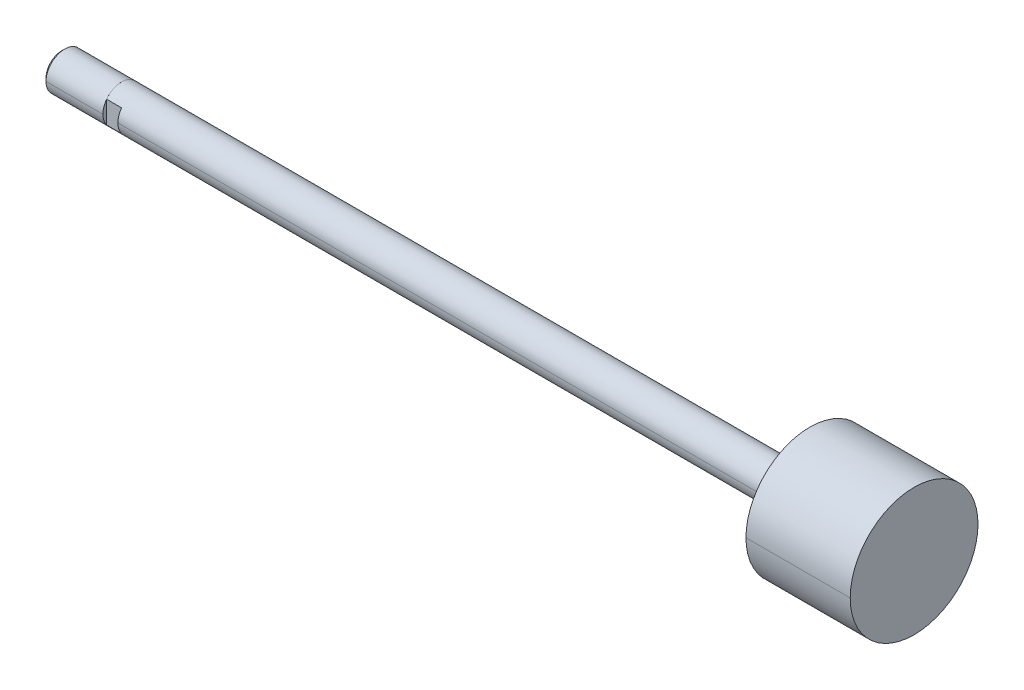
ISO-10303-21;
HEADER;
FILE_DESCRIPTION(('STEP AP214'),'2;1');
FILE_NAME('part.step','',(''),(''),'','','');
FILE_SCHEMA(('AUTOMOTIVE_DESIGN { 1 0 10303 214 1 1 1 1 }'));
ENDSEC;
DATA;
#1=APPLICATION_CONTEXT('core data for automotive mechanical design processes');
#2=APPLICATION_PROTOCOL_DEFINITION('international standard','automotive_design',2000,#1);
#3=PRODUCT_CONTEXT('',#1,'mechanical');
#4=PRODUCT('Part','Part','',(#3));
#5=PRODUCT_RELATED_PRODUCT_CATEGORY('part','',(#4));
#6=PRODUCT_DEFINITION_FORMATION('','',#4);
#7=PRODUCT_DEFINITION_CONTEXT('part definition',#1,'design');
#8=PRODUCT_DEFINITION('design','',#6,#7);
#9=PRODUCT_DEFINITION_SHAPE('','',#8);
#10=(LENGTH_UNIT() NAMED_UNIT(*) SI_UNIT(.MILLI.,.METRE.));
#11=(NAMED_UNIT(*) PLANE_ANGLE_UNIT() SI_UNIT($,.RADIAN.));
#12=(NAMED_UNIT(*) SI_UNIT($,.STERADIAN.) SOLID_ANGLE_UNIT());
#13=UNCERTAINTY_MEASURE_WITH_UNIT(LENGTH_MEASURE(1.E-05),#10,'distance_accuracy_value','');
#14=(GEOMETRIC_REPRESENTATION_CONTEXT(3) GLOBAL_UNCERTAINTY_ASSIGNED_CONTEXT((#13)) GLOBAL_UNIT_ASSIGNED_CONTEXT((#10,
#11,#12)) REPRESENTATION_CONTEXT('',''));
#15=CARTESIAN_POINT('',(0.,0.,0.));
#16=DIRECTION('',(0.,0.,1.));
#17=DIRECTION('',(1.,0.,0.));
#18=AXIS2_PLACEMENT_3D('',#15,#16,#17);
#19=CARTESIAN_POINT('',(164.9984,0.,0.));
#20=DIRECTION('',(-1.,0.,0.));
#21=DIRECTION('',(0.,-1.,0.));
#22=AXIS2_PLACEMENT_3D('',#19,#20,#21);
#23=CYLINDRICAL_SURFACE('',#22,3.9624);
#24=CARTESIAN_POINT('',(142.875,0.,0.));
#25=DIRECTION('',(1.,0.,0.));
#26=DIRECTION('',(0.,0.,-1.));
#27=AXIS2_PLACEMENT_3D('',#24,#25,#26);
#28=CIRCLE('',#27,3.9624);
#29=CARTESIAN_POINT('',(142.875,0.,-3.9624));
#30=VERTEX_POINT('',#29);
#31=CARTESIAN_POINT('',(142.875,0.,3.9624));
#32=VERTEX_POINT('',#31);
#33=EDGE_CURVE('E10',#30,#32,#28,.T.);
#34=ORIENTED_EDGE('',*,*,#33,.F.);
#35=DIRECTION('',(-1.,0.,0.));
#36=VECTOR('',#35,1.);
#37=CARTESIAN_POINT('',(142.875,0.,-3.9624));
#38=LINE('',#37,#36);
#39=CARTESIAN_POINT('',(0.,0.,-3.9624));
#40=VERTEX_POINT('',#39);
#41=EDGE_CURVE('E24',#30,#40,#38,.T.);
#42=ORIENTED_EDGE('',*,*,#41,.T.);
#43=CARTESIAN_POINT('',(0.,0.,0.));
#44=DIRECTION('',(1.,0.,0.));
#45=DIRECTION('',(0.,0.,-1.));
#46=AXIS2_PLACEMENT_3D('',#43,#44,#45);
#47=CIRCLE('',#46,3.9624);
#48=CARTESIAN_POINT('',(0.,2.37065154757084,-3.175));
#49=VERTEX_POINT('',#48);
#50=EDGE_CURVE('E244',#40,#49,#47,.T.);
#51=ORIENTED_EDGE('',*,*,#50,.T.);
#52=DIRECTION('',(1.,0.,0.));
#53=VECTOR('',#52,1.);
#54=CARTESIAN_POINT('',(164.9984,2.37065154757084,-3.175));
#55=LINE('',#54,#53);
#56=CARTESIAN_POINT('',(-3.175,2.37065154757084,-3.175));
#57=VERTEX_POINT('',#56);
#58=EDGE_CURVE('E239',#57,#49,#55,.T.);
#59=ORIENTED_EDGE('',*,*,#58,.F.);
#60=CARTESIAN_POINT('',(-3.175,0.,0.));
#61=DIRECTION('',(1.,0.,0.));
#62=DIRECTION('',(0.,0.,-1.));
#63=AXIS2_PLACEMENT_3D('',#60,#61,#62);
#64=CIRCLE('',#63,3.9624);
#65=CARTESIAN_POINT('',(-3.175,2.37065154757084,3.175));
#66=VERTEX_POINT('',#65);
#67=EDGE_CURVE('E235',#57,#66,#64,.T.);
#68=ORIENTED_EDGE('',*,*,#67,.T.);
#69=DIRECTION('',(1.,0.,0.));
#70=VECTOR('',#69,1.);
#71=CARTESIAN_POINT('',(164.9984,2.37065154757084,3.175));
#72=LINE('',#71,#70);
#73=CARTESIAN_POINT('',(0.,2.37065154757084,3.175));
#74=VERTEX_POINT('',#73);
#75=EDGE_CURVE('E231',#66,#74,#72,.T.);
#76=ORIENTED_EDGE('',*,*,#75,.T.);
#77=CARTESIAN_POINT('',(0.,0.,0.));
#78=DIRECTION('',(1.,0.,0.));
#79=DIRECTION('',(0.,0.,-1.));
#80=AXIS2_PLACEMENT_3D('',#77,#78,#79);
#81=CIRCLE('',#80,3.9624);
#82=CARTESIAN_POINT('',(0.,0.,3.9624));
#83=VERTEX_POINT('',#82);
#84=EDGE_CURVE('E227',#74,#83,#81,.T.);
#85=ORIENTED_EDGE('',*,*,#84,.T.);
#86=DIRECTION('',(-1.,0.,0.));
#87=VECTOR('',#86,1.);
#88=CARTESIAN_POINT('',(142.875,0.,3.9624));
#89=LINE('',#88,#87);
#90=EDGE_CURVE('E222',#32,#83,#89,.T.);
#91=ORIENTED_EDGE('',*,*,#90,.F.);
#92=EDGE_LOOP('',(#34,#42,#51,#59,#68,#76,#85,#91));
#93=FACE_BOUND('',#92,.T.);
#94=ADVANCED_FACE('F16',(#93),#23,.T.);
#95=CARTESIAN_POINT('',(164.9984,0.,0.));
#96=DIRECTION('',(-1.,0.,0.));
#97=DIRECTION('',(0.,1.,0.));
#98=AXIS2_PLACEMENT_3D('',#95,#96,#97);
#99=CYLINDRICAL_SURFACE('',#98,3.9624);
#100=CARTESIAN_POINT('',(0.,0.,0.));
#101=DIRECTION('',(1.,0.,0.));
#102=DIRECTION('',(0.,0.,-1.));
#103=AXIS2_PLACEMENT_3D('',#100,#101,#102);
#104=CIRCLE('',#103,3.9624);
#105=CARTESIAN_POINT('',(0.,-2.37065154757084,3.175));
#106=VERTEX_POINT('',#105);
#107=EDGE_CURVE('E218',#83,#106,#104,.T.);
#108=ORIENTED_EDGE('',*,*,#107,.T.);
#109=DIRECTION('',(1.,0.,0.));
#110=VECTOR('',#109,1.);
#111=CARTESIAN_POINT('',(164.9984,-2.37065154757084,3.175));
#112=LINE('',#111,#110);
#113=CARTESIAN_POINT('',(-3.175,-2.37065154757084,3.175));
#114=VERTEX_POINT('',#113);
#115=EDGE_CURVE('E213',#114,#106,#112,.T.);
#116=ORIENTED_EDGE('',*,*,#115,.F.);
#117=CARTESIAN_POINT('',(-3.175,0.,0.));
#118=DIRECTION('',(1.,0.,0.));
#119=DIRECTION('',(0.,0.,-1.));
#120=AXIS2_PLACEMENT_3D('',#117,#118,#119);
#121=CIRCLE('',#120,3.9624);
#122=CARTESIAN_POINT('',(-3.175,-2.37065154757084,-3.175));
#123=VERTEX_POINT('',#122);
#124=EDGE_CURVE('E209',#114,#123,#121,.T.);
#125=ORIENTED_EDGE('',*,*,#124,.T.);
#126=DIRECTION('',(1.,0.,0.));
#127=VECTOR('',#126,1.);
#128=CARTESIAN_POINT('',(164.9984,-2.37065154757084,-3.175));
#129=LINE('',#128,#127);
#130=CARTESIAN_POINT('',(0.,-2.37065154757084,-3.175));
#131=VERTEX_POINT('',#130);
#132=EDGE_CURVE('E205',#123,#131,#129,.T.);
#133=ORIENTED_EDGE('',*,*,#132,.T.);
#134=CARTESIAN_POINT('',(0.,0.,0.));
#135=DIRECTION('',(1.,0.,0.));
#136=DIRECTION('',(0.,0.,-1.));
#137=AXIS2_PLACEMENT_3D('',#134,#135,#136);
#138=CIRCLE('',#137,3.9624);
#139=EDGE_CURVE('E201',#131,#40,#138,.T.);
#140=ORIENTED_EDGE('',*,*,#139,.T.);
#141=ORIENTED_EDGE('',*,*,#41,.F.);
#142=CARTESIAN_POINT('',(142.875,0.,0.));
#143=DIRECTION('',(1.,0.,0.));
#144=DIRECTION('',(0.,0.,-1.));
#145=AXIS2_PLACEMENT_3D('',#142,#143,#144);
#146=CIRCLE('',#145,3.9624);
#147=EDGE_CURVE('E196',#32,#30,#146,.T.);
#148=ORIENTED_EDGE('',*,*,#147,.F.);
#149=ORIENTED_EDGE('',*,*,#90,.T.);
#150=EDGE_LOOP('',(#108,#116,#125,#133,#140,#141,#148,#149));
#151=FACE_BOUND('',#150,.T.);
#152=ADVANCED_FACE('F276',(#151),#99,.T.);
#153=CARTESIAN_POINT('',(142.875,3.9624,0.));
#154=DIRECTION('',(1.,0.,0.));
#155=DIRECTION('',(0.,0.,-1.));
#156=AXIS2_PLACEMENT_3D('',#153,#154,#155);
#157=PLANE('',#156);
#158=CARTESIAN_POINT('',(142.875,0.,0.));
#159=DIRECTION('',(1.,0.,0.));
#160=DIRECTION('',(0.,0.,-1.));
#161=AXIS2_PLACEMENT_3D('',#158,#159,#160);
#162=CIRCLE('',#161,13.55725);
#163=CARTESIAN_POINT('',(142.875,0.,-13.55725));
#164=VERTEX_POINT('',#163);
#165=CARTESIAN_POINT('',(142.875,0.,13.55725));
#166=VERTEX_POINT('',#165);
#167=EDGE_CURVE('E191',#164,#166,#162,.T.);
#168=ORIENTED_EDGE('',*,*,#167,.F.);
#169=CARTESIAN_POINT('',(142.875,0.,0.));
#170=DIRECTION('',(1.,0.,0.));
#171=DIRECTION('',(0.,0.,-1.));
#172=AXIS2_PLACEMENT_3D('',#169,#170,#171);
#173=CIRCLE('',#172,13.55725);
#174=EDGE_CURVE('E186',#166,#164,#173,.T.);
#175=ORIENTED_EDGE('',*,*,#174,.F.);
#176=EDGE_LOOP('',(#168,#175));
#177=FACE_BOUND('',#176,.T.);
#178=ORIENTED_EDGE('',*,*,#33,.T.);
#179=ORIENTED_EDGE('',*,*,#147,.T.);
#180=EDGE_LOOP('',(#178,#179));
#181=FACE_BOUND('',#180,.T.);
#182=ADVANCED_FACE('F279',(#177,#181),#157,.F.);
#183=CARTESIAN_POINT('',(164.9984,0.,0.));
#184=DIRECTION('',(-1.,0.,0.));
#185=DIRECTION('',(0.,1.,0.));
#186=AXIS2_PLACEMENT_3D('',#183,#184,#185);
#187=CYLINDRICAL_SURFACE('',#186,13.55725);
#188=ORIENTED_EDGE('',*,*,#174,.T.);
#189=DIRECTION('',(-1.,0.,0.));
#190=VECTOR('',#189,1.);
#191=CARTESIAN_POINT('',(164.9984,0.,-13.55725));
#192=LINE('',#191,#190);
#193=CARTESIAN_POINT('',(164.9984,0.,-13.55725));
#194=VERTEX_POINT('',#193);
#195=EDGE_CURVE('E181',#194,#164,#192,.T.);
#196=ORIENTED_EDGE('',*,*,#195,.F.);
#197=CARTESIAN_POINT('',(164.9984,0.,0.));
#198=DIRECTION('',(1.,0.,0.));
#199=DIRECTION('',(0.,0.,-1.));
#200=AXIS2_PLACEMENT_3D('',#197,#198,#199);
#201=CIRCLE('',#200,13.55725);
#202=CARTESIAN_POINT('',(164.9984,0.,13.55725));
#203=VERTEX_POINT('',#202);
#204=EDGE_CURVE('E176',#203,#194,#201,.T.);
#205=ORIENTED_EDGE('',*,*,#204,.F.);
#206=DIRECTION('',(-1.,0.,0.));
#207=VECTOR('',#206,1.);
#208=CARTESIAN_POINT('',(164.9984,0.,13.55725));
#209=LINE('',#208,#207);
#210=EDGE_CURVE('E171',#203,#166,#209,.T.);
#211=ORIENTED_EDGE('',*,*,#210,.T.);
#212=EDGE_LOOP('',(#188,#196,#205,#211));
#213=FACE_BOUND('',#212,.T.);
#214=ADVANCED_FACE('F281',(#213),#187,.T.);
#215=CARTESIAN_POINT('',(164.9984,0.,0.));
#216=DIRECTION('',(-1.,0.,0.));
#217=DIRECTION('',(0.,-1.,0.));
#218=AXIS2_PLACEMENT_3D('',#215,#216,#217);
#219=CYLINDRICAL_SURFACE('',#218,13.55725);
#220=CARTESIAN_POINT('',(164.9984,0.,0.));
#221=DIRECTION('',(1.,0.,0.));
#222=DIRECTION('',(0.,0.,-1.));
#223=AXIS2_PLACEMENT_3D('',#220,#221,#222);
#224=CIRCLE('',#223,13.55725);
#225=EDGE_CURVE('E166',#194,#203,#224,.T.);
#226=ORIENTED_EDGE('',*,*,#225,.F.);
#227=ORIENTED_EDGE('',*,*,#195,.T.);
#228=ORIENTED_EDGE('',*,*,#167,.T.);
#229=ORIENTED_EDGE('',*,*,#210,.F.);
#230=EDGE_LOOP('',(#226,#227,#228,#229));
#231=FACE_BOUND('',#230,.T.);
#232=ADVANCED_FACE('F289',(#231),#219,.T.);
#233=CARTESIAN_POINT('',(164.9984,13.55725,0.));
#234=DIRECTION('',(-1.,0.,0.));
#235=DIRECTION('',(0.,0.,1.));
#236=AXIS2_PLACEMENT_3D('',#233,#234,#235);
#237=PLANE('',#236);
#238=ORIENTED_EDGE('',*,*,#225,.T.);
#239=ORIENTED_EDGE('',*,*,#204,.T.);
#240=EDGE_LOOP('',(#238,#239));
#241=FACE_BOUND('',#240,.T.);
#242=ADVANCED_FACE('F322',(#241),#237,.F.);
#243=CARTESIAN_POINT('',(0.,0.,0.));
#244=DIRECTION('',(1.,0.,0.));
#245=DIRECTION('',(0.,0.,-1.));
#246=AXIS2_PLACEMENT_3D('',#243,#244,#245);
#247=PLANE('',#246);
#248=DIRECTION('',(0.,1.,0.));
#249=VECTOR('',#248,1.);
#250=CARTESIAN_POINT('',(0.,-3.9624,-3.175));
#251=LINE('',#250,#249);
#252=EDGE_CURVE('E161',#131,#49,#251,.T.);
#253=ORIENTED_EDGE('',*,*,#252,.T.);
#254=ORIENTED_EDGE('',*,*,#50,.F.);
#255=ORIENTED_EDGE('',*,*,#139,.F.);
#256=EDGE_LOOP('',(#253,#254,#255));
#257=FACE_BOUND('',#256,.T.);
#258=ADVANCED_FACE('F256',(#257),#247,.F.);
#259=CARTESIAN_POINT('',(0.,-3.9624,-3.175));
#260=DIRECTION('',(0.,0.,1.));
#261=DIRECTION('',(1.,0.,0.));
#262=AXIS2_PLACEMENT_3D('',#259,#260,#261);
#263=PLANE('',#262);
#264=DIRECTION('',(0.,1.,0.));
#265=VECTOR('',#264,1.);
#266=CARTESIAN_POINT('',(-3.175,-3.9624,-3.175));
#267=LINE('',#266,#265);
#268=EDGE_CURVE('E156',#123,#57,#267,.T.);
#269=ORIENTED_EDGE('',*,*,#268,.T.);
#270=ORIENTED_EDGE('',*,*,#58,.T.);
#271=ORIENTED_EDGE('',*,*,#252,.F.);
#272=ORIENTED_EDGE('',*,*,#132,.F.);
#273=EDGE_LOOP('',(#269,#270,#271,#272));
#274=FACE_BOUND('',#273,.T.);
#275=ADVANCED_FACE('F259',(#274),#263,.F.);
#276=CARTESIAN_POINT('',(-3.175,3.96875,0.));
#277=DIRECTION('',(-1.,0.,0.));
#278=DIRECTION('',(0.,0.,1.));
#279=AXIS2_PLACEMENT_3D('',#276,#277,#278);
#280=PLANE('',#279);
#281=ORIENTED_EDGE('',*,*,#67,.F.);
#282=ORIENTED_EDGE('',*,*,#268,.F.);
#283=ORIENTED_EDGE('',*,*,#124,.F.);
#284=DIRECTION('',(0.,-1.,0.));
#285=VECTOR('',#284,1.);
#286=CARTESIAN_POINT('',(-3.175,3.9624,3.175));
#287=LINE('',#286,#285);
#288=EDGE_CURVE('E151',#66,#114,#287,.T.);
#289=ORIENTED_EDGE('',*,*,#288,.F.);
#290=EDGE_LOOP('',(#281,#282,#283,#289));
#291=FACE_BOUND('',#290,.T.);
#292=CARTESIAN_POINT('',(-3.175,0.,0.));
#293=DIRECTION('',(1.,0.,0.));
#294=DIRECTION('',(0.,0.,-1.));
#295=AXIS2_PLACEMENT_3D('',#292,#293,#294);
#296=CIRCLE('',#295,3.96875);
#297=CARTESIAN_POINT('',(-3.175,0.,-3.96875));
#298=VERTEX_POINT('',#297);
#299=CARTESIAN_POINT('',(-3.175,0.,3.96875));
#300=VERTEX_POINT('',#299);
#301=EDGE_CURVE('E147',#298,#300,#296,.T.);
#302=ORIENTED_EDGE('',*,*,#301,.T.);
#303=CARTESIAN_POINT('',(-3.175,0.,0.));
#304=DIRECTION('',(1.,0.,0.));
#305=DIRECTION('',(0.,0.,-1.));
#306=AXIS2_PLACEMENT_3D('',#303,#304,#305);
#307=CIRCLE('',#306,3.96875);
#308=EDGE_CURVE('E143',#300,#298,#307,.T.);
#309=ORIENTED_EDGE('',*,*,#308,.T.);
#310=EDGE_LOOP('',(#302,#309));
#311=FACE_BOUND('',#310,.T.);
#312=ADVANCED_FACE('F265',(#291,#311),#280,.F.);
#313=CARTESIAN_POINT('',(-3.175,0.,0.));
#314=DIRECTION('',(-1.,0.,0.));
#315=DIRECTION('',(0.,1.,0.));
#316=AXIS2_PLACEMENT_3D('',#313,#314,#315);
#317=CYLINDRICAL_SURFACE('',#316,3.96875);
#318=CARTESIAN_POINT('',(-15.24508,0.,0.));
#319=DIRECTION('',(1.,0.,0.));
#320=DIRECTION('',(0.,0.,-1.));
#321=AXIS2_PLACEMENT_3D('',#318,#319,#320);
#322=CIRCLE('',#321,3.96875);
#323=CARTESIAN_POINT('',(-15.2450800000016,0.,3.96875000000161));
#324=VERTEX_POINT('',#323);
#325=CARTESIAN_POINT('',(-15.24508,0.,-3.96875));
#326=VERTEX_POINT('',#325);
#327=EDGE_CURVE('E109',#324,#326,#322,.T.);
#328=ORIENTED_EDGE('',*,*,#327,.T.);
#329=DIRECTION('',(-1.,0.,0.));
#330=VECTOR('',#329,1.);
#331=CARTESIAN_POINT('',(-3.175,0.,-3.96875));
#332=LINE('',#331,#330);
#333=EDGE_CURVE('E135',#298,#326,#332,.T.);
#334=ORIENTED_EDGE('',*,*,#333,.F.);
#335=ORIENTED_EDGE('',*,*,#308,.F.);
#336=DIRECTION('',(-1.,0.,0.));
#337=VECTOR('',#336,1.);
#338=CARTESIAN_POINT('',(-3.175,0.,3.96875));
#339=LINE('',#338,#337);
#340=EDGE_CURVE('E131',#300,#324,#339,.T.);
#341=ORIENTED_EDGE('',*,*,#340,.T.);
#342=EDGE_LOOP('',(#328,#334,#335,#341));
#343=FACE_BOUND('',#342,.T.);
#344=ADVANCED_FACE('F357',(#343),#317,.T.);
#345=CARTESIAN_POINT('',(-3.175,0.,0.));
#346=DIRECTION('',(-1.,0.,0.));
#347=DIRECTION('',(0.,-1.,0.));
#348=AXIS2_PLACEMENT_3D('',#345,#346,#347);
#349=CYLINDRICAL_SURFACE('',#348,3.96875);
#350=ORIENTED_EDGE('',*,*,#301,.F.);
#351=ORIENTED_EDGE('',*,*,#333,.T.);
#352=CARTESIAN_POINT('',(-15.24508,0.,0.));
#353=DIRECTION('',(1.,0.,0.));
#354=DIRECTION('',(0.,0.,-1.));
#355=AXIS2_PLACEMENT_3D('',#352,#353,#354);
#356=CIRCLE('',#355,3.96875);
#357=EDGE_CURVE('E126',#326,#324,#356,.T.);
#358=ORIENTED_EDGE('',*,*,#357,.T.);
#359=ORIENTED_EDGE('',*,*,#340,.F.);
#360=EDGE_LOOP('',(#350,#351,#358,#359));
#361=FACE_BOUND('',#360,.T.);
#362=ADVANCED_FACE('F366',(#361),#349,.T.);
#363=CARTESIAN_POINT('',(-15.875,0.,0.));
#364=DIRECTION('',(1.,0.,0.));
#365=DIRECTION('',(0.,-1.,0.));
#366=AXIS2_PLACEMENT_3D('',#363,#364,#365);
#367=CONICAL_SURFACE('',#366,3.33883,0.7853981634);
#368=ORIENTED_EDGE('',*,*,#357,.F.);
#369=DIRECTION('',(0.707106781184745,0.,-0.70710678118835));
#370=VECTOR('',#369,1.);
#371=CARTESIAN_POINT('',(-15.875,0.,-3.33883));
#372=LINE('',#371,#370);
#373=CARTESIAN_POINT('',(-15.875,0.,-3.33883));
#374=VERTEX_POINT('',#373);
#375=EDGE_CURVE('E101',#374,#326,#372,.T.);
#376=ORIENTED_EDGE('',*,*,#375,.F.);
#377=CARTESIAN_POINT('',(-15.875,0.,0.));
#378=DIRECTION('',(1.,0.,0.));
#379=DIRECTION('',(0.,0.,-1.));
#380=AXIS2_PLACEMENT_3D('',#377,#378,#379);
#381=CIRCLE('',#380,3.33883);
#382=CARTESIAN_POINT('',(-15.875,0.,3.33883));
#383=VERTEX_POINT('',#382);
#384=EDGE_CURVE('E94',#374,#383,#381,.T.);
#385=ORIENTED_EDGE('',*,*,#384,.T.);
#386=DIRECTION('',(0.707106781184743,0.,0.707106781188352));
#387=VECTOR('',#386,1.);
#388=CARTESIAN_POINT('',(-15.875,0.,3.33883));
#389=LINE('',#388,#387);
#390=EDGE_CURVE('E98',#383,#324,#389,.T.);
#391=ORIENTED_EDGE('',*,*,#390,.T.);
#392=EDGE_LOOP('',(#368,#376,#385,#391));
#393=FACE_BOUND('',#392,.T.);
#394=ADVANCED_FACE('F97',(#393),#367,.T.);
#395=CARTESIAN_POINT('',(-15.875,0.,0.));
#396=DIRECTION('',(1.,0.,0.));
#397=DIRECTION('',(0.,1.,0.));
#398=AXIS2_PLACEMENT_3D('',#395,#396,#397);
#399=CONICAL_SURFACE('',#398,3.33883,0.7853981634);
#400=CARTESIAN_POINT('',(-15.875,0.,0.));
#401=DIRECTION('',(1.,0.,0.));
#402=DIRECTION('',(0.,0.,-1.));
#403=AXIS2_PLACEMENT_3D('',#400,#401,#402);
#404=CIRCLE('',#403,3.33883);
#405=EDGE_CURVE('E108',#383,#374,#404,.T.);
#406=ORIENTED_EDGE('',*,*,#405,.T.);
#407=ORIENTED_EDGE('',*,*,#375,.T.);
#408=ORIENTED_EDGE('',*,*,#327,.F.);
#409=ORIENTED_EDGE('',*,*,#390,.F.);
#410=EDGE_LOOP('',(#406,#407,#408,#409));
#411=FACE_BOUND('',#410,.T.);
#412=ADVANCED_FACE('F107',(#411),#399,.T.);
#413=CARTESIAN_POINT('',(-15.875,0.,0.));
#414=DIRECTION('',(1.,0.,0.));
#415=DIRECTION('',(0.,0.,-1.));
#416=AXIS2_PLACEMENT_3D('',#413,#414,#415);
#417=PLANE('',#416);
#418=ORIENTED_EDGE('',*,*,#384,.F.);
#419=ORIENTED_EDGE('',*,*,#405,.F.);
#420=EDGE_LOOP('',(#418,#419));
#421=FACE_BOUND('',#420,.T.);
#422=ADVANCED_FACE('F111',(#421),#417,.F.);
#423=CARTESIAN_POINT('',(0.,3.9624,3.175));
#424=DIRECTION('',(0.,0.,-1.));
#425=DIRECTION('',(-1.,0.,0.));
#426=AXIS2_PLACEMENT_3D('',#423,#424,#425);
#427=PLANE('',#426);
#428=ORIENTED_EDGE('',*,*,#288,.T.);
#429=ORIENTED_EDGE('',*,*,#115,.T.);
#430=DIRECTION('',(0.,-1.,0.));
#431=VECTOR('',#430,1.);
#432=CARTESIAN_POINT('',(0.,3.9624,3.175));
#433=LINE('',#432,#431);
#434=EDGE_CURVE('E112',#74,#106,#433,.T.);
#435=ORIENTED_EDGE('',*,*,#434,.F.);
#436=ORIENTED_EDGE('',*,*,#75,.F.);
#437=EDGE_LOOP('',(#428,#429,#435,#436));
#438=FACE_BOUND('',#437,.T.);
#439=ADVANCED_FACE('F271',(#438),#427,.F.);
#440=CARTESIAN_POINT('',(0.,0.,0.));
#441=DIRECTION('',(1.,0.,0.));
#442=DIRECTION('',(0.,0.,-1.));
#443=AXIS2_PLACEMENT_3D('',#440,#441,#442);
#444=PLANE('',#443);
#445=ORIENTED_EDGE('',*,*,#434,.T.);
#446=ORIENTED_EDGE('',*,*,#107,.F.);
#447=ORIENTED_EDGE('',*,*,#84,.F.);
#448=EDGE_LOOP('',(#445,#446,#447));
#449=FACE_BOUND('',#448,.T.);
#450=ADVANCED_FACE('F274',(#449),#444,.F.);
#451=CLOSED_SHELL('',(#94,#152,#182,#214,#232,#242,#258,#275,#312,#344,#362,#394,#412,#422,#439,#450));
#452=MANIFOLD_SOLID_BREP('B1',#451);
#453=ADVANCED_BREP_SHAPE_REPRESENTATION('',(#18,#452),#14);
#454=SHAPE_DEFINITION_REPRESENTATION(#9,#453);
ENDSEC;
END-ISO-10303-21;
